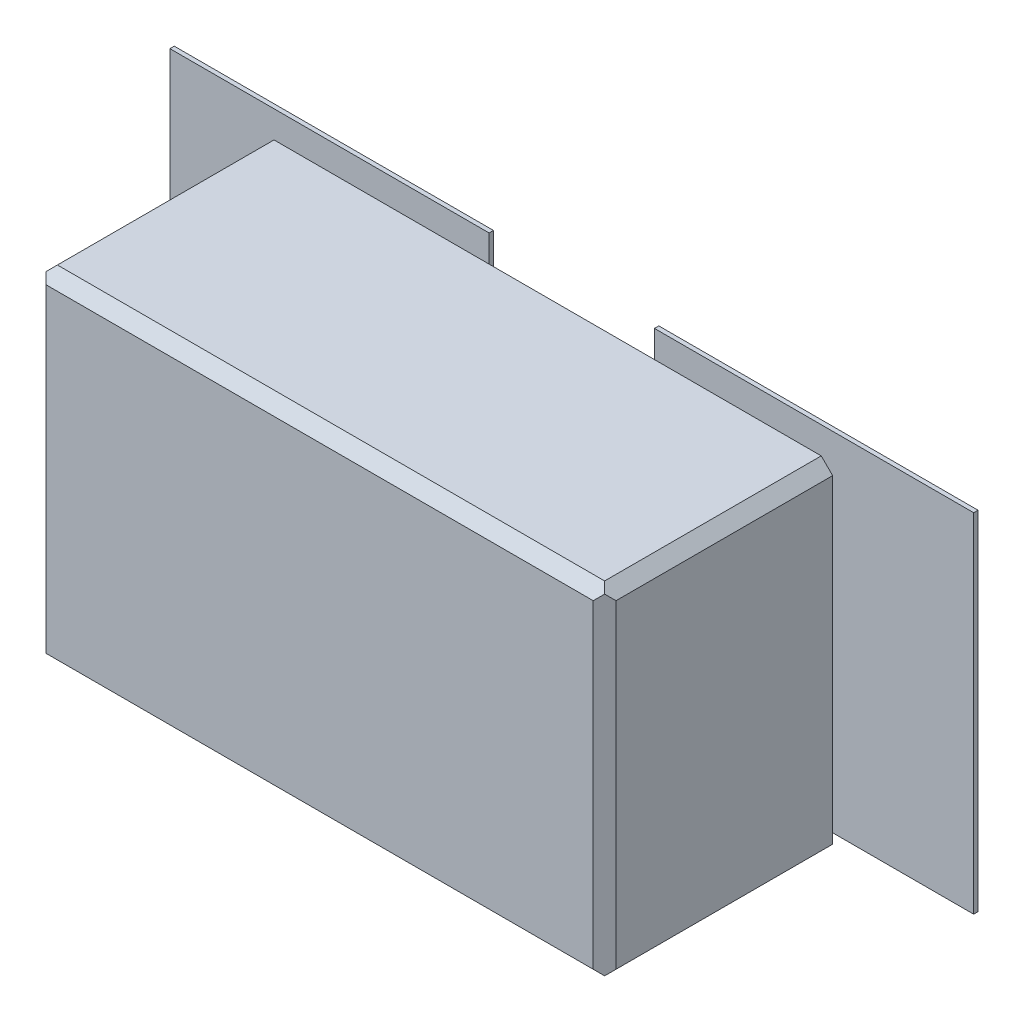
ISO-10303-21;
HEADER;
FILE_DESCRIPTION(('STEP AP214'),'2;1');
FILE_NAME('part.step','',(''),(''),'','','');
FILE_SCHEMA(('AUTOMOTIVE_DESIGN { 1 0 10303 214 1 1 1 1 }'));
ENDSEC;
DATA;
#1=APPLICATION_CONTEXT('core data for automotive mechanical design processes');
#2=APPLICATION_PROTOCOL_DEFINITION('international standard','automotive_design',2000,#1);
#3=PRODUCT_CONTEXT('',#1,'mechanical');
#4=PRODUCT('Part','Part','',(#3));
#5=PRODUCT_RELATED_PRODUCT_CATEGORY('part','',(#4));
#6=PRODUCT_DEFINITION_FORMATION('','',#4);
#7=PRODUCT_DEFINITION_CONTEXT('part definition',#1,'design');
#8=PRODUCT_DEFINITION('design','',#6,#7);
#9=PRODUCT_DEFINITION_SHAPE('','',#8);
#10=(LENGTH_UNIT() NAMED_UNIT(*) SI_UNIT(.MILLI.,.METRE.));
#11=(NAMED_UNIT(*) PLANE_ANGLE_UNIT() SI_UNIT($,.RADIAN.));
#12=(NAMED_UNIT(*) SI_UNIT($,.STERADIAN.) SOLID_ANGLE_UNIT());
#13=UNCERTAINTY_MEASURE_WITH_UNIT(LENGTH_MEASURE(1.E-05),#10,'distance_accuracy_value','');
#14=(GEOMETRIC_REPRESENTATION_CONTEXT(3) GLOBAL_UNCERTAINTY_ASSIGNED_CONTEXT((#13)) GLOBAL_UNIT_ASSIGNED_CONTEXT((#10,
#11,#12)) REPRESENTATION_CONTEXT('',''));
#15=CARTESIAN_POINT('',(0.,0.,0.));
#16=DIRECTION('',(0.,0.,1.));
#17=DIRECTION('',(1.,0.,0.));
#18=AXIS2_PLACEMENT_3D('',#15,#16,#17);
#19=CARTESIAN_POINT('',(0.,0.,0.08382));
#20=DIRECTION('',(0.,0.,1.));
#21=DIRECTION('',(1.,0.,0.));
#22=AXIS2_PLACEMENT_3D('',#19,#20,#21);
#23=PLANE('',#22);
#24=DIRECTION('',(0.,1.,0.));
#25=VECTOR('',#24,1.);
#26=CARTESIAN_POINT('',(0.145,0.305,0.08382));
#27=LINE('',#26,#25);
#28=CARTESIAN_POINT('',(0.145,-0.305,0.08382));
#29=VERTEX_POINT('',#28);
#30=CARTESIAN_POINT('',(0.145,0.305,0.08382));
#31=VERTEX_POINT('',#30);
#32=EDGE_CURVE('P0_E68',#29,#31,#27,.T.);
#33=ORIENTED_EDGE('',*,*,#32,.F.);
#34=DIRECTION('',(1.,0.,0.));
#35=VECTOR('',#34,1.);
#36=CARTESIAN_POINT('',(0.145,-0.305,0.08382));
#37=LINE('',#36,#35);
#38=CARTESIAN_POINT('',(0.705,-0.305,0.08382));
#39=VERTEX_POINT('',#38);
#40=EDGE_CURVE('P0_E20',#39,#29,#37,.F.);
#41=ORIENTED_EDGE('',*,*,#40,.F.);
#42=DIRECTION('',(0.,1.,0.));
#43=VECTOR('',#42,1.);
#44=CARTESIAN_POINT('',(0.705,-0.305,0.08382));
#45=LINE('',#44,#43);
#46=CARTESIAN_POINT('',(0.705,0.305,0.08382));
#47=VERTEX_POINT('',#46);
#48=EDGE_CURVE('P0_E58',#47,#39,#45,.F.);
#49=ORIENTED_EDGE('',*,*,#48,.F.);
#50=DIRECTION('',(1.,0.,0.));
#51=VECTOR('',#50,1.);
#52=CARTESIAN_POINT('',(0.705,0.305,0.08382));
#53=LINE('',#52,#51);
#54=EDGE_CURVE('P0_E53',#31,#47,#53,.T.);
#55=ORIENTED_EDGE('',*,*,#54,.F.);
#56=EDGE_LOOP('',(#33,#41,#49,#55));
#57=FACE_BOUND('',#56,.T.);
#58=ADVANCED_FACE('P0_F17',(#57),#23,.T.);
#59=CARTESIAN_POINT('',(0.145,-0.305,0.0762));
#60=DIRECTION('',(0.,-1.,0.));
#61=DIRECTION('',(0.,0.,-1.));
#62=AXIS2_PLACEMENT_3D('',#59,#60,#61);
#63=PLANE('',#62);
#64=DIRECTION('',(0.,0.,1.));
#65=VECTOR('',#64,1.);
#66=CARTESIAN_POINT('',(0.145,-0.305,0.0762));
#67=LINE('',#66,#65);
#68=CARTESIAN_POINT('',(0.145,-0.305,0.0762));
#69=VERTEX_POINT('',#68);
#70=EDGE_CURVE('P0_E79',#69,#29,#67,.T.);
#71=ORIENTED_EDGE('',*,*,#70,.F.);
#72=DIRECTION('',(1.,0.,0.));
#73=VECTOR('',#72,1.);
#74=CARTESIAN_POINT('',(0.,-0.305,0.0762));
#75=LINE('',#74,#73);
#76=CARTESIAN_POINT('',(0.705,-0.305,0.0762));
#77=VERTEX_POINT('',#76);
#78=EDGE_CURVE('P0_E74',#69,#77,#75,.T.);
#79=ORIENTED_EDGE('',*,*,#78,.T.);
#80=DIRECTION('',(0.,0.,-1.));
#81=VECTOR('',#80,1.);
#82=CARTESIAN_POINT('',(0.705,-0.305,0.0762));
#83=LINE('',#82,#81);
#84=EDGE_CURVE('P0_E63',#39,#77,#83,.T.);
#85=ORIENTED_EDGE('',*,*,#84,.F.);
#86=ORIENTED_EDGE('',*,*,#40,.T.);
#87=EDGE_LOOP('',(#71,#79,#85,#86));
#88=FACE_BOUND('',#87,.T.);
#89=ADVANCED_FACE('P0_F73',(#88),#63,.T.);
#90=CARTESIAN_POINT('',(0.705,-0.305,0.0762));
#91=DIRECTION('',(1.,0.,0.));
#92=DIRECTION('',(0.,0.,-1.));
#93=AXIS2_PLACEMENT_3D('',#90,#91,#92);
#94=PLANE('',#93);
#95=ORIENTED_EDGE('',*,*,#84,.T.);
#96=DIRECTION('',(0.,1.,0.));
#97=VECTOR('',#96,1.);
#98=CARTESIAN_POINT('',(0.705,0.,0.0762));
#99=LINE('',#98,#97);
#100=CARTESIAN_POINT('',(0.705,0.305,0.0762));
#101=VERTEX_POINT('',#100);
#102=EDGE_CURVE('P0_E84',#77,#101,#99,.T.);
#103=ORIENTED_EDGE('',*,*,#102,.T.);
#104=DIRECTION('',(0.,0.,1.));
#105=VECTOR('',#104,1.);
#106=CARTESIAN_POINT('',(0.705,0.305,0.0762));
#107=LINE('',#106,#105);
#108=EDGE_CURVE('P0_E65',#47,#101,#107,.F.);
#109=ORIENTED_EDGE('',*,*,#108,.F.);
#110=ORIENTED_EDGE('',*,*,#48,.T.);
#111=EDGE_LOOP('',(#95,#103,#109,#110));
#112=FACE_BOUND('',#111,.T.);
#113=ADVANCED_FACE('P0_F60',(#112),#94,.T.);
#114=CARTESIAN_POINT('',(0.705,0.305,0.0762));
#115=DIRECTION('',(0.,1.,0.));
#116=DIRECTION('',(0.,0.,1.));
#117=AXIS2_PLACEMENT_3D('',#114,#115,#116);
#118=PLANE('',#117);
#119=ORIENTED_EDGE('',*,*,#108,.T.);
#120=DIRECTION('',(1.,0.,0.));
#121=VECTOR('',#120,1.);
#122=CARTESIAN_POINT('',(0.,0.305,0.0762));
#123=LINE('',#122,#121);
#124=CARTESIAN_POINT('',(0.145,0.305,0.0762));
#125=VERTEX_POINT('',#124);
#126=EDGE_CURVE('P0_E26',#101,#125,#123,.F.);
#127=ORIENTED_EDGE('',*,*,#126,.T.);
#128=DIRECTION('',(0.,0.,1.));
#129=VECTOR('',#128,1.);
#130=CARTESIAN_POINT('',(0.145,0.305,0.0762));
#131=LINE('',#130,#129);
#132=EDGE_CURVE('P0_E34',#31,#125,#131,.F.);
#133=ORIENTED_EDGE('',*,*,#132,.F.);
#134=ORIENTED_EDGE('',*,*,#54,.T.);
#135=EDGE_LOOP('',(#119,#127,#133,#134));
#136=FACE_BOUND('',#135,.T.);
#137=ADVANCED_FACE('P0_F88',(#136),#118,.T.);
#138=CARTESIAN_POINT('',(0.145,0.305,0.0762));
#139=DIRECTION('',(-1.,0.,0.));
#140=DIRECTION('',(0.,0.,1.));
#141=AXIS2_PLACEMENT_3D('',#138,#139,#140);
#142=PLANE('',#141);
#143=ORIENTED_EDGE('',*,*,#132,.T.);
#144=DIRECTION('',(0.,1.,0.));
#145=VECTOR('',#144,1.);
#146=CARTESIAN_POINT('',(0.145,0.,0.0762));
#147=LINE('',#146,#145);
#148=EDGE_CURVE('P0_E11',#125,#69,#147,.F.);
#149=ORIENTED_EDGE('',*,*,#148,.T.);
#150=ORIENTED_EDGE('',*,*,#70,.T.);
#151=ORIENTED_EDGE('',*,*,#32,.T.);
#152=EDGE_LOOP('',(#143,#149,#150,#151));
#153=FACE_BOUND('',#152,.T.);
#154=ADVANCED_FACE('P0_F91',(#153),#142,.T.);
#155=CARTESIAN_POINT('',(0.,0.,0.0762));
#156=DIRECTION('',(0.,0.,1.));
#157=DIRECTION('',(1.,0.,0.));
#158=AXIS2_PLACEMENT_3D('',#155,#156,#157);
#159=PLANE('',#158);
#160=ORIENTED_EDGE('',*,*,#126,.F.);
#161=ORIENTED_EDGE('',*,*,#102,.F.);
#162=ORIENTED_EDGE('',*,*,#78,.F.);
#163=ORIENTED_EDGE('',*,*,#148,.F.);
#164=EDGE_LOOP('',(#160,#161,#162,#163));
#165=FACE_BOUND('',#164,.T.);
#166=ADVANCED_FACE('P0_F90',(#165),#159,.F.);
#167=CLOSED_SHELL('',(#58,#89,#113,#137,#154,#166));
#168=MANIFOLD_SOLID_BREP('P0_B1',#167);
#169=CARTESIAN_POINT('',(0.,0.,0.08382));
#170=DIRECTION('',(0.,0.,1.));
#171=DIRECTION('',(1.,0.,0.));
#172=AXIS2_PLACEMENT_3D('',#169,#170,#171);
#173=PLANE('',#172);
#174=DIRECTION('',(0.,1.,0.));
#175=VECTOR('',#174,1.);
#176=CARTESIAN_POINT('',(-0.705,0.305,0.08382));
#177=LINE('',#176,#175);
#178=CARTESIAN_POINT('',(-0.705,-0.305,0.08382));
#179=VERTEX_POINT('',#178);
#180=CARTESIAN_POINT('',(-0.705,0.305,0.08382));
#181=VERTEX_POINT('',#180);
#182=EDGE_CURVE('P1_E68',#179,#181,#177,.T.);
#183=ORIENTED_EDGE('',*,*,#182,.F.);
#184=DIRECTION('',(1.,0.,0.));
#185=VECTOR('',#184,1.);
#186=CARTESIAN_POINT('',(-0.705,-0.305,0.08382));
#187=LINE('',#186,#185);
#188=CARTESIAN_POINT('',(-0.145,-0.305,0.08382));
#189=VERTEX_POINT('',#188);
#190=EDGE_CURVE('P1_E20',#189,#179,#187,.F.);
#191=ORIENTED_EDGE('',*,*,#190,.F.);
#192=DIRECTION('',(0.,1.,0.));
#193=VECTOR('',#192,1.);
#194=CARTESIAN_POINT('',(-0.145,-0.305,0.08382));
#195=LINE('',#194,#193);
#196=CARTESIAN_POINT('',(-0.145,0.305,0.08382));
#197=VERTEX_POINT('',#196);
#198=EDGE_CURVE('P1_E58',#197,#189,#195,.F.);
#199=ORIENTED_EDGE('',*,*,#198,.F.);
#200=DIRECTION('',(1.,0.,0.));
#201=VECTOR('',#200,1.);
#202=CARTESIAN_POINT('',(-0.145,0.305,0.08382));
#203=LINE('',#202,#201);
#204=EDGE_CURVE('P1_E53',#181,#197,#203,.T.);
#205=ORIENTED_EDGE('',*,*,#204,.F.);
#206=EDGE_LOOP('',(#183,#191,#199,#205));
#207=FACE_BOUND('',#206,.T.);
#208=ADVANCED_FACE('P1_F17',(#207),#173,.T.);
#209=CARTESIAN_POINT('',(-0.705,-0.305,0.0762));
#210=DIRECTION('',(0.,-1.,0.));
#211=DIRECTION('',(0.,0.,-1.));
#212=AXIS2_PLACEMENT_3D('',#209,#210,#211);
#213=PLANE('',#212);
#214=DIRECTION('',(0.,0.,1.));
#215=VECTOR('',#214,1.);
#216=CARTESIAN_POINT('',(-0.705,-0.305,0.0762));
#217=LINE('',#216,#215);
#218=CARTESIAN_POINT('',(-0.705,-0.305,0.0762));
#219=VERTEX_POINT('',#218);
#220=EDGE_CURVE('P1_E79',#219,#179,#217,.T.);
#221=ORIENTED_EDGE('',*,*,#220,.F.);
#222=DIRECTION('',(1.,0.,0.));
#223=VECTOR('',#222,1.);
#224=CARTESIAN_POINT('',(0.,-0.305,0.0762));
#225=LINE('',#224,#223);
#226=CARTESIAN_POINT('',(-0.145,-0.305,0.0762));
#227=VERTEX_POINT('',#226);
#228=EDGE_CURVE('P1_E74',#219,#227,#225,.T.);
#229=ORIENTED_EDGE('',*,*,#228,.T.);
#230=DIRECTION('',(0.,0.,-1.));
#231=VECTOR('',#230,1.);
#232=CARTESIAN_POINT('',(-0.145,-0.305,0.0762));
#233=LINE('',#232,#231);
#234=EDGE_CURVE('P1_E63',#189,#227,#233,.T.);
#235=ORIENTED_EDGE('',*,*,#234,.F.);
#236=ORIENTED_EDGE('',*,*,#190,.T.);
#237=EDGE_LOOP('',(#221,#229,#235,#236));
#238=FACE_BOUND('',#237,.T.);
#239=ADVANCED_FACE('P1_F73',(#238),#213,.T.);
#240=CARTESIAN_POINT('',(-0.145,-0.305,0.0762));
#241=DIRECTION('',(1.,0.,0.));
#242=DIRECTION('',(0.,0.,-1.));
#243=AXIS2_PLACEMENT_3D('',#240,#241,#242);
#244=PLANE('',#243);
#245=ORIENTED_EDGE('',*,*,#234,.T.);
#246=DIRECTION('',(0.,1.,0.));
#247=VECTOR('',#246,1.);
#248=CARTESIAN_POINT('',(-0.145,0.,0.0762));
#249=LINE('',#248,#247);
#250=CARTESIAN_POINT('',(-0.145,0.305,0.0762));
#251=VERTEX_POINT('',#250);
#252=EDGE_CURVE('P1_E84',#227,#251,#249,.T.);
#253=ORIENTED_EDGE('',*,*,#252,.T.);
#254=DIRECTION('',(0.,0.,1.));
#255=VECTOR('',#254,1.);
#256=CARTESIAN_POINT('',(-0.145,0.305,0.0762));
#257=LINE('',#256,#255);
#258=EDGE_CURVE('P1_E65',#197,#251,#257,.F.);
#259=ORIENTED_EDGE('',*,*,#258,.F.);
#260=ORIENTED_EDGE('',*,*,#198,.T.);
#261=EDGE_LOOP('',(#245,#253,#259,#260));
#262=FACE_BOUND('',#261,.T.);
#263=ADVANCED_FACE('P1_F60',(#262),#244,.T.);
#264=CARTESIAN_POINT('',(-0.145,0.305,0.0762));
#265=DIRECTION('',(0.,1.,0.));
#266=DIRECTION('',(0.,0.,1.));
#267=AXIS2_PLACEMENT_3D('',#264,#265,#266);
#268=PLANE('',#267);
#269=ORIENTED_EDGE('',*,*,#258,.T.);
#270=DIRECTION('',(1.,0.,0.));
#271=VECTOR('',#270,1.);
#272=CARTESIAN_POINT('',(0.,0.305,0.0762));
#273=LINE('',#272,#271);
#274=CARTESIAN_POINT('',(-0.705,0.305,0.0762));
#275=VERTEX_POINT('',#274);
#276=EDGE_CURVE('P1_E26',#251,#275,#273,.F.);
#277=ORIENTED_EDGE('',*,*,#276,.T.);
#278=DIRECTION('',(0.,0.,1.));
#279=VECTOR('',#278,1.);
#280=CARTESIAN_POINT('',(-0.705,0.305,0.0762));
#281=LINE('',#280,#279);
#282=EDGE_CURVE('P1_E34',#181,#275,#281,.F.);
#283=ORIENTED_EDGE('',*,*,#282,.F.);
#284=ORIENTED_EDGE('',*,*,#204,.T.);
#285=EDGE_LOOP('',(#269,#277,#283,#284));
#286=FACE_BOUND('',#285,.T.);
#287=ADVANCED_FACE('P1_F88',(#286),#268,.T.);
#288=CARTESIAN_POINT('',(-0.705,0.305,0.0762));
#289=DIRECTION('',(-1.,0.,0.));
#290=DIRECTION('',(0.,0.,1.));
#291=AXIS2_PLACEMENT_3D('',#288,#289,#290);
#292=PLANE('',#291);
#293=ORIENTED_EDGE('',*,*,#282,.T.);
#294=DIRECTION('',(0.,1.,0.));
#295=VECTOR('',#294,1.);
#296=CARTESIAN_POINT('',(-0.705,0.,0.0762));
#297=LINE('',#296,#295);
#298=EDGE_CURVE('P1_E11',#275,#219,#297,.F.);
#299=ORIENTED_EDGE('',*,*,#298,.T.);
#300=ORIENTED_EDGE('',*,*,#220,.T.);
#301=ORIENTED_EDGE('',*,*,#182,.T.);
#302=EDGE_LOOP('',(#293,#299,#300,#301));
#303=FACE_BOUND('',#302,.T.);
#304=ADVANCED_FACE('P1_F91',(#303),#292,.T.);
#305=CARTESIAN_POINT('',(0.,0.,0.0762));
#306=DIRECTION('',(0.,0.,1.));
#307=DIRECTION('',(1.,0.,0.));
#308=AXIS2_PLACEMENT_3D('',#305,#306,#307);
#309=PLANE('',#308);
#310=ORIENTED_EDGE('',*,*,#276,.F.);
#311=ORIENTED_EDGE('',*,*,#252,.F.);
#312=ORIENTED_EDGE('',*,*,#228,.F.);
#313=ORIENTED_EDGE('',*,*,#298,.F.);
#314=EDGE_LOOP('',(#310,#311,#312,#313));
#315=FACE_BOUND('',#314,.T.);
#316=ADVANCED_FACE('P1_F90',(#315),#309,.F.);
#317=CLOSED_SHELL('',(#208,#239,#263,#287,#304,#316));
#318=MANIFOLD_SOLID_BREP('P1_B1',#317);
#319=CARTESIAN_POINT('',(0.,0.,0.0862));
#320=DIRECTION('',(0.,0.,-1.));
#321=DIRECTION('',(-1.,0.,0.));
#322=AXIS2_PLACEMENT_3D('',#319,#320,#321);
#323=PLANE('',#322);
#324=DIRECTION('',(1.,0.,0.));
#325=VECTOR('',#324,1.);
#326=CARTESIAN_POINT('',(-0.4159973957868,0.25,0.0862));
#327=LINE('',#326,#325);
#328=CARTESIAN_POINT('',(-0.2159973957868,0.25,0.0862));
#329=VERTEX_POINT('',#328);
#330=CARTESIAN_POINT('',(-0.4159973957868,0.25,0.0862));
#331=VERTEX_POINT('',#330);
#332=EDGE_CURVE('P2_E184',#329,#331,#327,.F.);
#333=ORIENTED_EDGE('',*,*,#332,.F.);
#334=DIRECTION('',(0.,1.,0.));
#335=VECTOR('',#334,1.);
#336=CARTESIAN_POINT('',(-0.2159973957868,0.25,0.0862));
#337=LINE('',#336,#335);
#338=CARTESIAN_POINT('',(-0.2159973957868,-0.25,0.0862));
#339=VERTEX_POINT('',#338);
#340=EDGE_CURVE('P2_E212',#339,#329,#337,.T.);
#341=ORIENTED_EDGE('',*,*,#340,.F.);
#342=DIRECTION('',(1.,0.,0.));
#343=VECTOR('',#342,1.);
#344=CARTESIAN_POINT('',(-0.2159973957868,-0.25,0.0862));
#345=LINE('',#344,#343);
#346=CARTESIAN_POINT('',(-0.4659973957868,-0.25,0.0862));
#347=VERTEX_POINT('',#346);
#348=EDGE_CURVE('P2_E163',#347,#339,#345,.T.);
#349=ORIENTED_EDGE('',*,*,#348,.F.);
#350=DIRECTION('',(0.,1.,0.));
#351=VECTOR('',#350,1.);
#352=CARTESIAN_POINT('',(-0.4659973957868,-0.25,0.0862));
#353=LINE('',#352,#351);
#354=CARTESIAN_POINT('',(-0.4659973957868,0.2,0.0862));
#355=VERTEX_POINT('',#354);
#356=EDGE_CURVE('P2_E157',#355,#347,#353,.F.);
#357=ORIENTED_EDGE('',*,*,#356,.F.);
#358=CARTESIAN_POINT('',(-0.4659973957868,0.25,0.0862));
#359=DIRECTION('',(0.,0.,-1.));
#360=DIRECTION('',(-1.,0.,0.));
#361=AXIS2_PLACEMENT_3D('',#358,#359,#360);
#362=CIRCLE('',#361,0.05);
#363=EDGE_CURVE('P2_E20',#355,#331,#362,.F.);
#364=ORIENTED_EDGE('',*,*,#363,.T.);
#365=EDGE_LOOP('',(#333,#341,#349,#357,#364));
#366=FACE_BOUND('',#365,.T.);
#367=ADVANCED_FACE('P2_F17',(#366),#323,.T.);
#368=CARTESIAN_POINT('',(0.,0.,0.0862));
#369=DIRECTION('',(0.,0.,-1.));
#370=DIRECTION('',(-1.,0.,0.));
#371=AXIS2_PLACEMENT_3D('',#368,#369,#370);
#372=PLANE('',#371);
#373=DIRECTION('',(1.,0.,0.));
#374=VECTOR('',#373,1.);
#375=CARTESIAN_POINT('',(0.1840026042132,0.25,0.0862));
#376=LINE('',#375,#374);
#377=CARTESIAN_POINT('',(0.4340026042132,0.25,0.0862));
#378=VERTEX_POINT('',#377);
#379=CARTESIAN_POINT('',(0.1840026042132,0.25,0.0862));
#380=VERTEX_POINT('',#379);
#381=EDGE_CURVE('P2_E232',#378,#380,#376,.F.);
#382=ORIENTED_EDGE('',*,*,#381,.F.);
#383=DIRECTION('',(0.,1.,0.));
#384=VECTOR('',#383,1.);
#385=CARTESIAN_POINT('',(0.4340026042132,0.25,0.0862));
#386=LINE('',#385,#384);
#387=CARTESIAN_POINT('',(0.4340026042132,-0.25,0.0862));
#388=VERTEX_POINT('',#387);
#389=EDGE_CURVE('P2_E249',#388,#378,#386,.T.);
#390=ORIENTED_EDGE('',*,*,#389,.F.);
#391=DIRECTION('',(1.,0.,0.));
#392=VECTOR('',#391,1.);
#393=CARTESIAN_POINT('',(0.4340026042132,-0.25,0.0862));
#394=LINE('',#393,#392);
#395=CARTESIAN_POINT('',(0.1840026042132,-0.25,0.0862));
#396=VERTEX_POINT('',#395);
#397=EDGE_CURVE('P2_E247',#396,#388,#394,.T.);
#398=ORIENTED_EDGE('',*,*,#397,.F.);
#399=DIRECTION('',(0.,1.,0.));
#400=VECTOR('',#399,1.);
#401=CARTESIAN_POINT('',(0.1840026042132,-0.25,0.0862));
#402=LINE('',#401,#400);
#403=EDGE_CURVE('P2_E241',#380,#396,#402,.F.);
#404=ORIENTED_EDGE('',*,*,#403,.F.);
#405=EDGE_LOOP('',(#382,#390,#398,#404));
#406=FACE_BOUND('',#405,.T.);
#407=ADVANCED_FACE('P2_F273',(#406),#372,.T.);
#408=CARTESIAN_POINT('',(-0.2159973957868,0.25,0.1262));
#409=DIRECTION('',(1.,0.,0.));
#410=DIRECTION('',(0.,0.,-1.));
#411=AXIS2_PLACEMENT_3D('',#408,#409,#410);
#412=PLANE('',#411);
#413=DIRECTION('',(0.,0.,1.));
#414=VECTOR('',#413,1.);
#415=CARTESIAN_POINT('',(-0.2159973957868,0.25,0.1262));
#416=LINE('',#415,#414);
#417=CARTESIAN_POINT('',(-0.2159973957868,0.25,0.1262));
#418=VERTEX_POINT('',#417);
#419=EDGE_CURVE('P2_E182',#418,#329,#416,.F.);
#420=ORIENTED_EDGE('',*,*,#419,.F.);
#421=DIRECTION('',(0.,1.,0.));
#422=VECTOR('',#421,1.);
#423=CARTESIAN_POINT('',(-0.2159973957868,0.,0.1262));
#424=LINE('',#423,#422);
#425=CARTESIAN_POINT('',(-0.2159973957868,-0.25,0.1262));
#426=VERTEX_POINT('',#425);
#427=EDGE_CURVE('P2_E194',#418,#426,#424,.F.);
#428=ORIENTED_EDGE('',*,*,#427,.T.);
#429=DIRECTION('',(0.,0.,-1.));
#430=VECTOR('',#429,1.);
#431=CARTESIAN_POINT('',(-0.2159973957868,-0.25,0.1262));
#432=LINE('',#431,#430);
#433=EDGE_CURVE('P2_E168',#339,#426,#432,.F.);
#434=ORIENTED_EDGE('',*,*,#433,.F.);
#435=ORIENTED_EDGE('',*,*,#340,.T.);
#436=EDGE_LOOP('',(#420,#428,#434,#435));
#437=FACE_BOUND('',#436,.T.);
#438=ADVANCED_FACE('P2_F262',(#437),#412,.T.);
#439=CARTESIAN_POINT('',(-0.2159973957868,-0.25,0.1262));
#440=DIRECTION('',(0.,-1.,0.));
#441=DIRECTION('',(0.,0.,-1.));
#442=AXIS2_PLACEMENT_3D('',#439,#440,#441);
#443=PLANE('',#442);
#444=ORIENTED_EDGE('',*,*,#433,.T.);
#445=DIRECTION('',(1.,0.,0.));
#446=VECTOR('',#445,1.);
#447=CARTESIAN_POINT('',(0.,-0.25,0.1262));
#448=LINE('',#447,#446);
#449=CARTESIAN_POINT('',(-0.4659973957868,-0.25,0.1262));
#450=VERTEX_POINT('',#449);
#451=EDGE_CURVE('P2_E196',#426,#450,#448,.F.);
#452=ORIENTED_EDGE('',*,*,#451,.T.);
#453=DIRECTION('',(0.,0.,1.));
#454=VECTOR('',#453,1.);
#455=CARTESIAN_POINT('',(-0.4659973957868,-0.25,0.1262));
#456=LINE('',#455,#454);
#457=EDGE_CURVE('P2_E167',#347,#450,#456,.T.);
#458=ORIENTED_EDGE('',*,*,#457,.F.);
#459=ORIENTED_EDGE('',*,*,#348,.T.);
#460=EDGE_LOOP('',(#444,#452,#458,#459));
#461=FACE_BOUND('',#460,.T.);
#462=ADVANCED_FACE('P2_F264',(#461),#443,.T.);
#463=CARTESIAN_POINT('',(-0.4659973957868,-0.25,0.1262));
#464=DIRECTION('',(-1.,0.,0.));
#465=DIRECTION('',(0.,0.,1.));
#466=AXIS2_PLACEMENT_3D('',#463,#464,#465);
#467=PLANE('',#466);
#468=ORIENTED_EDGE('',*,*,#457,.T.);
#469=DIRECTION('',(0.,1.,0.));
#470=VECTOR('',#469,1.);
#471=CARTESIAN_POINT('',(-0.4659973957868,0.,0.1262));
#472=LINE('',#471,#470);
#473=CARTESIAN_POINT('',(-0.4659973957868,0.2,0.1262));
#474=VERTEX_POINT('',#473);
#475=EDGE_CURVE('P2_E174',#450,#474,#472,.T.);
#476=ORIENTED_EDGE('',*,*,#475,.T.);
#477=DIRECTION('',(0.,0.,-1.));
#478=VECTOR('',#477,1.);
#479=CARTESIAN_POINT('',(-0.4659973957868,0.2,0.1262));
#480=LINE('',#479,#478);
#481=EDGE_CURVE('P2_E171',#474,#355,#480,.T.);
#482=ORIENTED_EDGE('',*,*,#481,.T.);
#483=ORIENTED_EDGE('',*,*,#356,.T.);
#484=EDGE_LOOP('',(#468,#476,#482,#483));
#485=FACE_BOUND('',#484,.T.);
#486=ADVANCED_FACE('P2_F172',(#485),#467,.T.);
#487=CARTESIAN_POINT('',(-0.4659973957868,0.25,0.1262));
#488=DIRECTION('',(0.,0.,-1.));
#489=DIRECTION('',(-1.,0.,0.));
#490=AXIS2_PLACEMENT_3D('',#487,#488,#489);
#491=CYLINDRICAL_SURFACE('',#490,0.05);
#492=ORIENTED_EDGE('',*,*,#363,.F.);
#493=ORIENTED_EDGE('',*,*,#481,.F.);
#494=CARTESIAN_POINT('',(-0.4659973957868,0.25,0.1262));
#495=DIRECTION('',(0.,0.,-1.));
#496=DIRECTION('',(-1.,0.,0.));
#497=AXIS2_PLACEMENT_3D('',#494,#495,#496);
#498=CIRCLE('',#497,0.05);
#499=CARTESIAN_POINT('',(-0.4159973957868,0.25,0.1262));
#500=VERTEX_POINT('',#499);
#501=EDGE_CURVE('P2_E220',#474,#500,#498,.F.);
#502=ORIENTED_EDGE('',*,*,#501,.T.);
#503=DIRECTION('',(0.,0.,1.));
#504=VECTOR('',#503,1.);
#505=CARTESIAN_POINT('',(-0.4159973957868,0.25,0.1262));
#506=LINE('',#505,#504);
#507=EDGE_CURVE('P2_E180',#331,#500,#506,.T.);
#508=ORIENTED_EDGE('',*,*,#507,.F.);
#509=EDGE_LOOP('',(#492,#493,#502,#508));
#510=FACE_BOUND('',#509,.T.);
#511=ADVANCED_FACE('P2_F178',(#510),#491,.F.);
#512=CARTESIAN_POINT('',(-0.4159973957868,0.25,0.1262));
#513=DIRECTION('',(0.,1.,0.));
#514=DIRECTION('',(0.,0.,1.));
#515=AXIS2_PLACEMENT_3D('',#512,#513,#514);
#516=PLANE('',#515);
#517=ORIENTED_EDGE('',*,*,#507,.T.);
#518=DIRECTION('',(1.,0.,0.));
#519=VECTOR('',#518,1.);
#520=CARTESIAN_POINT('',(0.,0.25,0.1262));
#521=LINE('',#520,#519);
#522=EDGE_CURVE('P2_E221',#500,#418,#521,.T.);
#523=ORIENTED_EDGE('',*,*,#522,.T.);
#524=ORIENTED_EDGE('',*,*,#419,.T.);
#525=ORIENTED_EDGE('',*,*,#332,.T.);
#526=EDGE_LOOP('',(#517,#523,#524,#525));
#527=FACE_BOUND('',#526,.T.);
#528=ADVANCED_FACE('P2_F254',(#527),#516,.T.);
#529=CARTESIAN_POINT('',(0.4340026042132,0.25,0.1262));
#530=DIRECTION('',(1.,0.,0.));
#531=DIRECTION('',(0.,0.,-1.));
#532=AXIS2_PLACEMENT_3D('',#529,#530,#531);
#533=PLANE('',#532);
#534=DIRECTION('',(0.,0.,1.));
#535=VECTOR('',#534,1.);
#536=CARTESIAN_POINT('',(0.4340026042132,0.25,0.1262));
#537=LINE('',#536,#535);
#538=CARTESIAN_POINT('',(0.4340026042132,0.25,0.1262));
#539=VERTEX_POINT('',#538);
#540=EDGE_CURVE('P2_E235',#539,#378,#537,.F.);
#541=ORIENTED_EDGE('',*,*,#540,.F.);
#542=DIRECTION('',(0.,1.,0.));
#543=VECTOR('',#542,1.);
#544=CARTESIAN_POINT('',(0.4340026042132,0.,0.1262));
#545=LINE('',#544,#543);
#546=CARTESIAN_POINT('',(0.4340026042132,-0.25,0.1262));
#547=VERTEX_POINT('',#546);
#548=EDGE_CURVE('P2_E222',#539,#547,#545,.F.);
#549=ORIENTED_EDGE('',*,*,#548,.T.);
#550=DIRECTION('',(0.,0.,-1.));
#551=VECTOR('',#550,1.);
#552=CARTESIAN_POINT('',(0.4340026042132,-0.25,0.1262));
#553=LINE('',#552,#551);
#554=EDGE_CURVE('P2_E244',#388,#547,#553,.F.);
#555=ORIENTED_EDGE('',*,*,#554,.F.);
#556=ORIENTED_EDGE('',*,*,#389,.T.);
#557=EDGE_LOOP('',(#541,#549,#555,#556));
#558=FACE_BOUND('',#557,.T.);
#559=ADVANCED_FACE('P2_F344',(#558),#533,.T.);
#560=CARTESIAN_POINT('',(0.4340026042132,-0.25,0.1262));
#561=DIRECTION('',(0.,-1.,0.));
#562=DIRECTION('',(0.,0.,-1.));
#563=AXIS2_PLACEMENT_3D('',#560,#561,#562);
#564=PLANE('',#563);
#565=ORIENTED_EDGE('',*,*,#554,.T.);
#566=DIRECTION('',(1.,0.,0.));
#567=VECTOR('',#566,1.);
#568=CARTESIAN_POINT('',(0.,-0.25,0.1262));
#569=LINE('',#568,#567);
#570=CARTESIAN_POINT('',(0.1840026042132,-0.25,0.1262));
#571=VERTEX_POINT('',#570);
#572=EDGE_CURVE('P2_E513',#547,#571,#569,.F.);
#573=ORIENTED_EDGE('',*,*,#572,.T.);
#574=DIRECTION('',(0.,0.,1.));
#575=VECTOR('',#574,1.);
#576=CARTESIAN_POINT('',(0.1840026042132,-0.25,0.1262));
#577=LINE('',#576,#575);
#578=EDGE_CURVE('P2_E238',#396,#571,#577,.T.);
#579=ORIENTED_EDGE('',*,*,#578,.F.);
#580=ORIENTED_EDGE('',*,*,#397,.T.);
#581=EDGE_LOOP('',(#565,#573,#579,#580));
#582=FACE_BOUND('',#581,.T.);
#583=ADVANCED_FACE('P2_F340',(#582),#564,.T.);
#584=CARTESIAN_POINT('',(0.1840026042132,-0.25,0.1262));
#585=DIRECTION('',(-1.,0.,0.));
#586=DIRECTION('',(0.,0.,1.));
#587=AXIS2_PLACEMENT_3D('',#584,#585,#586);
#588=PLANE('',#587);
#589=ORIENTED_EDGE('',*,*,#578,.T.);
#590=DIRECTION('',(0.,1.,0.));
#591=VECTOR('',#590,1.);
#592=CARTESIAN_POINT('',(0.1840026042132,0.,0.1262));
#593=LINE('',#592,#591);
#594=CARTESIAN_POINT('',(0.1840026042132,0.25,0.1262));
#595=VERTEX_POINT('',#594);
#596=EDGE_CURVE('P2_E517',#571,#595,#593,.T.);
#597=ORIENTED_EDGE('',*,*,#596,.T.);
#598=DIRECTION('',(0.,0.,1.));
#599=VECTOR('',#598,1.);
#600=CARTESIAN_POINT('',(0.1840026042132,0.25,0.1262));
#601=LINE('',#600,#599);
#602=EDGE_CURVE('P2_E197',#380,#595,#601,.T.);
#603=ORIENTED_EDGE('',*,*,#602,.F.);
#604=ORIENTED_EDGE('',*,*,#403,.T.);
#605=EDGE_LOOP('',(#589,#597,#603,#604));
#606=FACE_BOUND('',#605,.T.);
#607=ADVANCED_FACE('P2_F336',(#606),#588,.T.);
#608=CARTESIAN_POINT('',(0.1840026042132,0.25,0.1262));
#609=DIRECTION('',(0.,1.,0.));
#610=DIRECTION('',(0.,0.,1.));
#611=AXIS2_PLACEMENT_3D('',#608,#609,#610);
#612=PLANE('',#611);
#613=ORIENTED_EDGE('',*,*,#602,.T.);
#614=DIRECTION('',(1.,0.,0.));
#615=VECTOR('',#614,1.);
#616=CARTESIAN_POINT('',(0.,0.25,0.1262));
#617=LINE('',#616,#615);
#618=EDGE_CURVE('P2_E510',#595,#539,#617,.T.);
#619=ORIENTED_EDGE('',*,*,#618,.T.);
#620=ORIENTED_EDGE('',*,*,#540,.T.);
#621=ORIENTED_EDGE('',*,*,#381,.T.);
#622=EDGE_LOOP('',(#613,#619,#620,#621));
#623=FACE_BOUND('',#622,.T.);
#624=ADVANCED_FACE('P2_F332',(#623),#612,.T.);
#625=CARTESIAN_POINT('',(0.,0.,0.1262));
#626=DIRECTION('',(0.,0.,1.));
#627=DIRECTION('',(1.,0.,0.));
#628=AXIS2_PLACEMENT_3D('',#625,#626,#627);
#629=PLANE('',#628);
#630=ORIENTED_EDGE('',*,*,#596,.F.);
#631=ORIENTED_EDGE('',*,*,#572,.F.);
#632=ORIENTED_EDGE('',*,*,#548,.F.);
#633=ORIENTED_EDGE('',*,*,#618,.F.);
#634=EDGE_LOOP('',(#630,#631,#632,#633));
#635=FACE_BOUND('',#634,.T.);
#636=ORIENTED_EDGE('',*,*,#501,.F.);
#637=ORIENTED_EDGE('',*,*,#475,.F.);
#638=ORIENTED_EDGE('',*,*,#451,.F.);
#639=ORIENTED_EDGE('',*,*,#427,.F.);
#640=ORIENTED_EDGE('',*,*,#522,.F.);
#641=EDGE_LOOP('',(#636,#637,#638,#639,#640));
#642=FACE_BOUND('',#641,.T.);
#643=DIRECTION('',(0.707106781186548,0.707106781186548,0.));
#644=VECTOR('',#643,1.);
#645=CARTESIAN_POINT('',(0.49,-0.29,0.1262));
#646=LINE('',#645,#644);
#647=CARTESIAN_POINT('',(0.48,-0.3,0.1262));
#648=VERTEX_POINT('',#647);
#649=CARTESIAN_POINT('',(0.5,-0.28,0.1262));
#650=VERTEX_POINT('',#649);
#651=EDGE_CURVE('P2_E552',#648,#650,#646,.T.);
#652=ORIENTED_EDGE('',*,*,#651,.F.);
#653=DIRECTION('',(1.,0.,0.));
#654=VECTOR('',#653,1.);
#655=CARTESIAN_POINT('',(-0.5,-0.3,0.1262));
#656=LINE('',#655,#654);
#657=CARTESIAN_POINT('',(-0.48,-0.3,0.1262));
#658=VERTEX_POINT('',#657);
#659=EDGE_CURVE('P2_E542',#658,#648,#656,.T.);
#660=ORIENTED_EDGE('',*,*,#659,.F.);
#661=DIRECTION('',(0.707106781186548,-0.707106781186548,0.));
#662=VECTOR('',#661,1.);
#663=CARTESIAN_POINT('',(-0.49,-0.29,0.1262));
#664=LINE('',#663,#662);
#665=CARTESIAN_POINT('',(-0.5,-0.28,0.1262));
#666=VERTEX_POINT('',#665);
#667=EDGE_CURVE('P2_E537',#666,#658,#664,.T.);
#668=ORIENTED_EDGE('',*,*,#667,.F.);
#669=DIRECTION('',(0.,1.,0.));
#670=VECTOR('',#669,1.);
#671=CARTESIAN_POINT('',(-0.5,0.3,0.1262));
#672=LINE('',#671,#670);
#673=CARTESIAN_POINT('',(-0.5,0.28,0.1262));
#674=VERTEX_POINT('',#673);
#675=EDGE_CURVE('P2_E532',#674,#666,#672,.F.);
#676=ORIENTED_EDGE('',*,*,#675,.F.);
#677=DIRECTION('',(-0.707106781186548,-0.707106781186548,0.));
#678=VECTOR('',#677,1.);
#679=CARTESIAN_POINT('',(-0.49,0.29,0.1262));
#680=LINE('',#679,#678);
#681=CARTESIAN_POINT('',(-0.48,0.3,0.1262));
#682=VERTEX_POINT('',#681);
#683=EDGE_CURVE('P2_E527',#682,#674,#680,.T.);
#684=ORIENTED_EDGE('',*,*,#683,.F.);
#685=DIRECTION('',(1.,0.,0.));
#686=VECTOR('',#685,1.);
#687=CARTESIAN_POINT('',(0.5,0.3,0.1262));
#688=LINE('',#687,#686);
#689=CARTESIAN_POINT('',(0.48,0.3,0.1262));
#690=VERTEX_POINT('',#689);
#691=EDGE_CURVE('P2_E522',#690,#682,#688,.F.);
#692=ORIENTED_EDGE('',*,*,#691,.F.);
#693=DIRECTION('',(-0.707106781186548,0.707106781186548,0.));
#694=VECTOR('',#693,1.);
#695=CARTESIAN_POINT('',(0.49,0.29,0.1262));
#696=LINE('',#695,#694);
#697=CARTESIAN_POINT('',(0.5,0.28,0.1262));
#698=VERTEX_POINT('',#697);
#699=EDGE_CURVE('P2_E546',#698,#690,#696,.T.);
#700=ORIENTED_EDGE('',*,*,#699,.F.);
#701=DIRECTION('',(0.,1.,0.));
#702=VECTOR('',#701,1.);
#703=CARTESIAN_POINT('',(0.5,-0.3,0.1262));
#704=LINE('',#703,#702);
#705=EDGE_CURVE('P2_E557',#650,#698,#704,.T.);
#706=ORIENTED_EDGE('',*,*,#705,.F.);
#707=EDGE_LOOP('',(#652,#660,#668,#676,#684,#692,#700,#706));
#708=FACE_BOUND('',#707,.T.);
#709=ADVANCED_FACE('P2_F257',(#635,#642,#708),#629,.F.);
#710=CARTESIAN_POINT('',(0.5,0.3,0.0762));
#711=DIRECTION('',(0.,1.,0.));
#712=DIRECTION('',(0.,0.,1.));
#713=AXIS2_PLACEMENT_3D('',#710,#711,#712);
#714=PLANE('',#713);
#715=DIRECTION('',(1.,0.,0.));
#716=VECTOR('',#715,1.);
#717=CARTESIAN_POINT('',(0.,0.3,0.5062));
#718=LINE('',#717,#716);
#719=CARTESIAN_POINT('',(0.48,0.3,0.5062));
#720=VERTEX_POINT('',#719);
#721=CARTESIAN_POINT('',(-0.48,0.3,0.5062));
#722=VERTEX_POINT('',#721);
#723=EDGE_CURVE('P2_E566',#720,#722,#718,.F.);
#724=ORIENTED_EDGE('',*,*,#723,.F.);
#725=DIRECTION('',(0.,0.,1.));
#726=VECTOR('',#725,1.);
#727=CARTESIAN_POINT('',(0.48,0.3,0.3262));
#728=LINE('',#727,#726);
#729=EDGE_CURVE('P2_E544',#690,#720,#728,.T.);
#730=ORIENTED_EDGE('',*,*,#729,.F.);
#731=ORIENTED_EDGE('',*,*,#691,.T.);
#732=DIRECTION('',(0.,0.,1.));
#733=VECTOR('',#732,1.);
#734=CARTESIAN_POINT('',(-0.48,0.3,0.3262));
#735=LINE('',#734,#733);
#736=EDGE_CURVE('P2_E524',#722,#682,#735,.F.);
#737=ORIENTED_EDGE('',*,*,#736,.F.);
#738=EDGE_LOOP('',(#724,#730,#731,#737));
#739=FACE_BOUND('',#738,.T.);
#740=ADVANCED_FACE('P2_F325',(#739),#714,.T.);
#741=CARTESIAN_POINT('',(-0.49,0.29,0.3262));
#742=DIRECTION('',(-0.707106781186548,0.707106781186548,0.));
#743=DIRECTION('',(-0.707106781186548,-0.707106781186548,0.));
#744=AXIS2_PLACEMENT_3D('',#741,#742,#743);
#745=PLANE('',#744);
#746=ORIENTED_EDGE('',*,*,#736,.T.);
#747=ORIENTED_EDGE('',*,*,#683,.T.);
#748=DIRECTION('',(0.,0.,1.));
#749=VECTOR('',#748,1.);
#750=CARTESIAN_POINT('',(-0.5,0.28,0.0762));
#751=LINE('',#750,#749);
#752=CARTESIAN_POINT('',(-0.5,0.28,0.5062));
#753=VERTEX_POINT('',#752);
#754=EDGE_CURVE('P2_E529',#753,#674,#751,.F.);
#755=ORIENTED_EDGE('',*,*,#754,.F.);
#756=DIRECTION('',(-0.577350269189627,-0.577350269189624,-0.577350269189627));
#757=VECTOR('',#756,1.);
#758=CARTESIAN_POINT('',(-0.49,0.29,0.5162));
#759=LINE('',#758,#757);
#760=CARTESIAN_POINT('',(-0.49,0.29,0.5162));
#761=VERTEX_POINT('',#760);
#762=EDGE_CURVE('P2_E576',#761,#753,#759,.T.);
#763=ORIENTED_EDGE('',*,*,#762,.F.);
#764=DIRECTION('',(-0.577350269189624,-0.577350269189627,0.577350269189627));
#765=VECTOR('',#764,1.);
#766=CARTESIAN_POINT('',(-0.48,0.3,0.5062));
#767=LINE('',#766,#765);
#768=EDGE_CURVE('P2_E569',#722,#761,#767,.T.);
#769=ORIENTED_EDGE('',*,*,#768,.F.);
#770=EDGE_LOOP('',(#746,#747,#755,#763,#769));
#771=FACE_BOUND('',#770,.T.);
#772=ADVANCED_FACE('P2_F321',(#771),#745,.T.);
#773=CARTESIAN_POINT('',(-0.5,0.3,0.0762));
#774=DIRECTION('',(-1.,0.,0.));
#775=DIRECTION('',(0.,0.,1.));
#776=AXIS2_PLACEMENT_3D('',#773,#774,#775);
#777=PLANE('',#776);
#778=ORIENTED_EDGE('',*,*,#675,.T.);
#779=DIRECTION('',(0.,0.,1.));
#780=VECTOR('',#779,1.);
#781=CARTESIAN_POINT('',(-0.5,-0.28,0.3262));
#782=LINE('',#781,#780);
#783=CARTESIAN_POINT('',(-0.5,-0.28,0.5062));
#784=VERTEX_POINT('',#783);
#785=EDGE_CURVE('P2_E534',#784,#666,#782,.F.);
#786=ORIENTED_EDGE('',*,*,#785,.F.);
#787=DIRECTION('',(0.,1.,0.));
#788=VECTOR('',#787,1.);
#789=CARTESIAN_POINT('',(-0.5,0.,0.5062));
#790=LINE('',#789,#788);
#791=EDGE_CURVE('P2_E579',#753,#784,#790,.F.);
#792=ORIENTED_EDGE('',*,*,#791,.F.);
#793=ORIENTED_EDGE('',*,*,#754,.T.);
#794=EDGE_LOOP('',(#778,#786,#792,#793));
#795=FACE_BOUND('',#794,.T.);
#796=ADVANCED_FACE('P2_F317',(#795),#777,.T.);
#797=CARTESIAN_POINT('',(-0.49,-0.29,0.3262));
#798=DIRECTION('',(-0.707106781186548,-0.707106781186548,0.));
#799=DIRECTION('',(0.707106781186548,-0.707106781186548,0.));
#800=AXIS2_PLACEMENT_3D('',#797,#798,#799);
#801=PLANE('',#800);
#802=ORIENTED_EDGE('',*,*,#785,.T.);
#803=ORIENTED_EDGE('',*,*,#667,.T.);
#804=DIRECTION('',(0.,0.,-1.));
#805=VECTOR('',#804,1.);
#806=CARTESIAN_POINT('',(-0.48,-0.3,0.0762));
#807=LINE('',#806,#805);
#808=CARTESIAN_POINT('',(-0.48,-0.3,0.5062));
#809=VERTEX_POINT('',#808);
#810=EDGE_CURVE('P2_E539',#809,#658,#807,.T.);
#811=ORIENTED_EDGE('',*,*,#810,.F.);
#812=DIRECTION('',(0.577350269189624,-0.577350269189627,-0.577350269189627));
#813=VECTOR('',#812,1.);
#814=CARTESIAN_POINT('',(-0.49,-0.29,0.5162));
#815=LINE('',#814,#813);
#816=CARTESIAN_POINT('',(-0.49,-0.29,0.5162));
#817=VERTEX_POINT('',#816);
#818=EDGE_CURVE('P2_E587',#817,#809,#815,.T.);
#819=ORIENTED_EDGE('',*,*,#818,.F.);
#820=DIRECTION('',(0.577350269189627,-0.577350269189624,0.577350269189627));
#821=VECTOR('',#820,1.);
#822=CARTESIAN_POINT('',(-0.5,-0.28,0.5062));
#823=LINE('',#822,#821);
#824=EDGE_CURVE('P2_E571',#784,#817,#823,.T.);
#825=ORIENTED_EDGE('',*,*,#824,.F.);
#826=EDGE_LOOP('',(#802,#803,#811,#819,#825));
#827=FACE_BOUND('',#826,.T.);
#828=ADVANCED_FACE('P2_F313',(#827),#801,.T.);
#829=CARTESIAN_POINT('',(-0.5,-0.3,0.0762));
#830=DIRECTION('',(0.,-1.,0.));
#831=DIRECTION('',(0.,0.,-1.));
#832=AXIS2_PLACEMENT_3D('',#829,#830,#831);
#833=PLANE('',#832);
#834=ORIENTED_EDGE('',*,*,#659,.T.);
#835=DIRECTION('',(0.,0.,1.));
#836=VECTOR('',#835,1.);
#837=CARTESIAN_POINT('',(0.48,-0.3,0.3262));
#838=LINE('',#837,#836);
#839=CARTESIAN_POINT('',(0.48,-0.3,0.5062));
#840=VERTEX_POINT('',#839);
#841=EDGE_CURVE('P2_E549',#840,#648,#838,.F.);
#842=ORIENTED_EDGE('',*,*,#841,.F.);
#843=DIRECTION('',(1.,0.,0.));
#844=VECTOR('',#843,1.);
#845=CARTESIAN_POINT('',(0.,-0.3,0.5062));
#846=LINE('',#845,#844);
#847=EDGE_CURVE('P2_E590',#809,#840,#846,.T.);
#848=ORIENTED_EDGE('',*,*,#847,.F.);
#849=ORIENTED_EDGE('',*,*,#810,.T.);
#850=EDGE_LOOP('',(#834,#842,#848,#849));
#851=FACE_BOUND('',#850,.T.);
#852=ADVANCED_FACE('P2_F309',(#851),#833,.T.);
#853=CARTESIAN_POINT('',(0.49,0.29,0.3262));
#854=DIRECTION('',(0.707106781186548,0.707106781186548,0.));
#855=DIRECTION('',(-0.707106781186548,0.707106781186548,0.));
#856=AXIS2_PLACEMENT_3D('',#853,#854,#855);
#857=PLANE('',#856);
#858=DIRECTION('',(0.,0.,-1.));
#859=VECTOR('',#858,1.);
#860=CARTESIAN_POINT('',(0.5,0.28,0.0762));
#861=LINE('',#860,#859);
#862=CARTESIAN_POINT('',(0.5,0.28,0.5062));
#863=VERTEX_POINT('',#862);
#864=EDGE_CURVE('P2_E560',#698,#863,#861,.F.);
#865=ORIENTED_EDGE('',*,*,#864,.F.);
#866=ORIENTED_EDGE('',*,*,#699,.T.);
#867=ORIENTED_EDGE('',*,*,#729,.T.);
#868=DIRECTION('',(-0.577350269189624,0.577350269189627,-0.577350269189627));
#869=VECTOR('',#868,1.);
#870=CARTESIAN_POINT('',(0.49,0.29,0.5162));
#871=LINE('',#870,#869);
#872=CARTESIAN_POINT('',(0.49,0.29,0.5162));
#873=VERTEX_POINT('',#872);
#874=EDGE_CURVE('P2_E563',#873,#720,#871,.T.);
#875=ORIENTED_EDGE('',*,*,#874,.F.);
#876=DIRECTION('',(-0.577350269189627,0.577350269189624,0.577350269189627));
#877=VECTOR('',#876,1.);
#878=CARTESIAN_POINT('',(0.5,0.28,0.5062));
#879=LINE('',#878,#877);
#880=EDGE_CURVE('P2_E593',#863,#873,#879,.T.);
#881=ORIENTED_EDGE('',*,*,#880,.F.);
#882=EDGE_LOOP('',(#865,#866,#867,#875,#881));
#883=FACE_BOUND('',#882,.T.);
#884=ADVANCED_FACE('P2_F305',(#883),#857,.T.);
#885=CARTESIAN_POINT('',(0.49,-0.29,0.3262));
#886=DIRECTION('',(0.707106781186548,-0.707106781186548,0.));
#887=DIRECTION('',(0.707106781186548,0.707106781186548,0.));
#888=AXIS2_PLACEMENT_3D('',#885,#886,#887);
#889=PLANE('',#888);
#890=ORIENTED_EDGE('',*,*,#841,.T.);
#891=ORIENTED_EDGE('',*,*,#651,.T.);
#892=DIRECTION('',(0.,0.,-1.));
#893=VECTOR('',#892,1.);
#894=CARTESIAN_POINT('',(0.5,-0.28,0.0762));
#895=LINE('',#894,#893);
#896=CARTESIAN_POINT('',(0.5,-0.28,0.5062));
#897=VERTEX_POINT('',#896);
#898=EDGE_CURVE('P2_E554',#897,#650,#895,.T.);
#899=ORIENTED_EDGE('',*,*,#898,.F.);
#900=DIRECTION('',(0.577350269189627,0.577350269189624,-0.577350269189627));
#901=VECTOR('',#900,1.);
#902=CARTESIAN_POINT('',(0.49,-0.29,0.5162));
#903=LINE('',#902,#901);
#904=CARTESIAN_POINT('',(0.49,-0.29,0.5162));
#905=VERTEX_POINT('',#904);
#906=EDGE_CURVE('P2_E600',#905,#897,#903,.T.);
#907=ORIENTED_EDGE('',*,*,#906,.F.);
#908=DIRECTION('',(0.577350269189624,0.577350269189627,0.577350269189627));
#909=VECTOR('',#908,1.);
#910=CARTESIAN_POINT('',(0.48,-0.3,0.5062));
#911=LINE('',#910,#909);
#912=EDGE_CURVE('P2_E582',#840,#905,#911,.T.);
#913=ORIENTED_EDGE('',*,*,#912,.F.);
#914=EDGE_LOOP('',(#890,#891,#899,#907,#913));
#915=FACE_BOUND('',#914,.T.);
#916=ADVANCED_FACE('P2_F301',(#915),#889,.T.);
#917=CARTESIAN_POINT('',(0.5,-0.3,0.0762));
#918=DIRECTION('',(1.,0.,0.));
#919=DIRECTION('',(0.,0.,-1.));
#920=AXIS2_PLACEMENT_3D('',#917,#918,#919);
#921=PLANE('',#920);
#922=ORIENTED_EDGE('',*,*,#705,.T.);
#923=ORIENTED_EDGE('',*,*,#864,.T.);
#924=DIRECTION('',(0.,1.,0.));
#925=VECTOR('',#924,1.);
#926=CARTESIAN_POINT('',(0.5,0.,0.5062));
#927=LINE('',#926,#925);
#928=EDGE_CURVE('P2_E603',#897,#863,#927,.T.);
#929=ORIENTED_EDGE('',*,*,#928,.F.);
#930=ORIENTED_EDGE('',*,*,#898,.T.);
#931=EDGE_LOOP('',(#922,#923,#929,#930));
#932=FACE_BOUND('',#931,.T.);
#933=ADVANCED_FACE('P2_F297',(#932),#921,.T.);
#934=CARTESIAN_POINT('',(0.,0.29,0.5162));
#935=DIRECTION('',(0.,0.707106781186548,0.707106781186548));
#936=DIRECTION('',(0.,-0.707106781186548,0.707106781186548));
#937=AXIS2_PLACEMENT_3D('',#934,#935,#936);
#938=PLANE('',#937);
#939=DIRECTION('',(-0.577350269189627,0.577350269189624,-0.577350269189627));
#940=VECTOR('',#939,1.);
#941=CARTESIAN_POINT('',(-0.48,0.28,0.5262));
#942=LINE('',#941,#940);
#943=CARTESIAN_POINT('',(-0.48,0.28,0.5262));
#944=VERTEX_POINT('',#943);
#945=EDGE_CURVE('P2_E573',#944,#761,#942,.T.);
#946=ORIENTED_EDGE('',*,*,#945,.F.);
#947=DIRECTION('',(1.,0.,0.));
#948=VECTOR('',#947,1.);
#949=CARTESIAN_POINT('',(0.,0.28,0.5262));
#950=LINE('',#949,#948);
#951=CARTESIAN_POINT('',(0.48,0.28,0.5262));
#952=VERTEX_POINT('',#951);
#953=EDGE_CURVE('P2_E606',#952,#944,#950,.F.);
#954=ORIENTED_EDGE('',*,*,#953,.F.);
#955=DIRECTION('',(-0.577350269189627,-0.577350269189624,0.577350269189627));
#956=VECTOR('',#955,1.);
#957=CARTESIAN_POINT('',(0.49,0.29,0.5162));
#958=LINE('',#957,#956);
#959=EDGE_CURVE('P2_E596',#873,#952,#958,.T.);
#960=ORIENTED_EDGE('',*,*,#959,.F.);
#961=ORIENTED_EDGE('',*,*,#874,.T.);
#962=ORIENTED_EDGE('',*,*,#723,.T.);
#963=ORIENTED_EDGE('',*,*,#768,.T.);
#964=EDGE_LOOP('',(#946,#954,#960,#961,#962,#963));
#965=FACE_BOUND('',#964,.T.);
#966=ADVANCED_FACE('P2_F293',(#965),#938,.T.);
#967=CARTESIAN_POINT('',(-0.49,0.,0.5162));
#968=DIRECTION('',(-0.707106781186548,0.,0.707106781186548));
#969=DIRECTION('',(0.707106781186548,0.,0.707106781186548));
#970=AXIS2_PLACEMENT_3D('',#967,#968,#969);
#971=PLANE('',#970);
#972=ORIENTED_EDGE('',*,*,#762,.T.);
#973=ORIENTED_EDGE('',*,*,#791,.T.);
#974=ORIENTED_EDGE('',*,*,#824,.T.);
#975=DIRECTION('',(-0.577350269189624,-0.577350269189627,-0.577350269189627));
#976=VECTOR('',#975,1.);
#977=CARTESIAN_POINT('',(-0.48,-0.28,0.5262));
#978=LINE('',#977,#976);
#979=CARTESIAN_POINT('',(-0.48,-0.28,0.5262));
#980=VERTEX_POINT('',#979);
#981=EDGE_CURVE('P2_E584',#980,#817,#978,.T.);
#982=ORIENTED_EDGE('',*,*,#981,.F.);
#983=DIRECTION('',(0.,1.,0.));
#984=VECTOR('',#983,1.);
#985=CARTESIAN_POINT('',(-0.48,0.,0.5262));
#986=LINE('',#985,#984);
#987=EDGE_CURVE('P2_E609',#944,#980,#986,.F.);
#988=ORIENTED_EDGE('',*,*,#987,.F.);
#989=ORIENTED_EDGE('',*,*,#945,.T.);
#990=EDGE_LOOP('',(#972,#973,#974,#982,#988,#989));
#991=FACE_BOUND('',#990,.T.);
#992=ADVANCED_FACE('P2_F290',(#991),#971,.T.);
#993=CARTESIAN_POINT('',(0.,-0.29,0.5162));
#994=DIRECTION('',(0.,-0.707106781186548,0.707106781186548));
#995=DIRECTION('',(0.,-0.707106781186548,-0.707106781186548));
#996=AXIS2_PLACEMENT_3D('',#993,#994,#995);
#997=PLANE('',#996);
#998=ORIENTED_EDGE('',*,*,#818,.T.);
#999=ORIENTED_EDGE('',*,*,#847,.T.);
#1000=ORIENTED_EDGE('',*,*,#912,.T.);
#1001=DIRECTION('',(0.577350269189627,-0.577350269189624,-0.577350269189627));
#1002=VECTOR('',#1001,1.);
#1003=CARTESIAN_POINT('',(0.48,-0.28,0.5262));
#1004=LINE('',#1003,#1002);
#1005=CARTESIAN_POINT('',(0.48,-0.28,0.5262));
#1006=VERTEX_POINT('',#1005);
#1007=EDGE_CURVE('P2_E35',#1006,#905,#1004,.T.);
#1008=ORIENTED_EDGE('',*,*,#1007,.F.);
#1009=DIRECTION('',(1.,0.,0.));
#1010=VECTOR('',#1009,1.);
#1011=CARTESIAN_POINT('',(0.,-0.28,0.5262));
#1012=LINE('',#1011,#1010);
#1013=EDGE_CURVE('P2_E26',#980,#1006,#1012,.T.);
#1014=ORIENTED_EDGE('',*,*,#1013,.F.);
#1015=ORIENTED_EDGE('',*,*,#981,.T.);
#1016=EDGE_LOOP('',(#998,#999,#1000,#1008,#1014,#1015));
#1017=FACE_BOUND('',#1016,.T.);
#1018=ADVANCED_FACE('P2_F283',(#1017),#997,.T.);
#1019=CARTESIAN_POINT('',(0.49,0.,0.5162));
#1020=DIRECTION('',(0.707106781186548,0.,0.707106781186548));
#1021=DIRECTION('',(0.707106781186548,0.,-0.707106781186548));
#1022=AXIS2_PLACEMENT_3D('',#1019,#1020,#1021);
#1023=PLANE('',#1022);
#1024=ORIENTED_EDGE('',*,*,#906,.T.);
#1025=ORIENTED_EDGE('',*,*,#928,.T.);
#1026=ORIENTED_EDGE('',*,*,#880,.T.);
#1027=ORIENTED_EDGE('',*,*,#959,.T.);
#1028=DIRECTION('',(0.,1.,0.));
#1029=VECTOR('',#1028,1.);
#1030=CARTESIAN_POINT('',(0.48,0.,0.5262));
#1031=LINE('',#1030,#1029);
#1032=EDGE_CURVE('P2_E11',#1006,#952,#1031,.T.);
#1033=ORIENTED_EDGE('',*,*,#1032,.F.);
#1034=ORIENTED_EDGE('',*,*,#1007,.T.);
#1035=EDGE_LOOP('',(#1024,#1025,#1026,#1027,#1033,#1034));
#1036=FACE_BOUND('',#1035,.T.);
#1037=ADVANCED_FACE('P2_F277',(#1036),#1023,.T.);
#1038=CARTESIAN_POINT('',(0.,0.,0.5262));
#1039=DIRECTION('',(0.,0.,1.));
#1040=DIRECTION('',(1.,0.,0.));
#1041=AXIS2_PLACEMENT_3D('',#1038,#1039,#1040);
#1042=PLANE('',#1041);
#1043=ORIENTED_EDGE('',*,*,#1013,.T.);
#1044=ORIENTED_EDGE('',*,*,#1032,.T.);
#1045=ORIENTED_EDGE('',*,*,#953,.T.);
#1046=ORIENTED_EDGE('',*,*,#987,.T.);
#1047=EDGE_LOOP('',(#1043,#1044,#1045,#1046));
#1048=FACE_BOUND('',#1047,.T.);
#1049=ADVANCED_FACE('P2_F275',(#1048),#1042,.T.);
#1050=CLOSED_SHELL('',(#367,#407,#438,#462,#486,#511,#528,#559,#583,#607,#624,#709,#740,#772,
#796,#828,#852,#884,#916,#933,#966,#992,#1018,#1037,#1049));
#1051=MANIFOLD_SOLID_BREP('P2_B1',#1050);
#1052=ADVANCED_BREP_SHAPE_REPRESENTATION('',(#18,#168,#318,#1051),#14);
#1053=SHAPE_DEFINITION_REPRESENTATION(#9,#1052);
ENDSEC;
END-ISO-10303-21;
